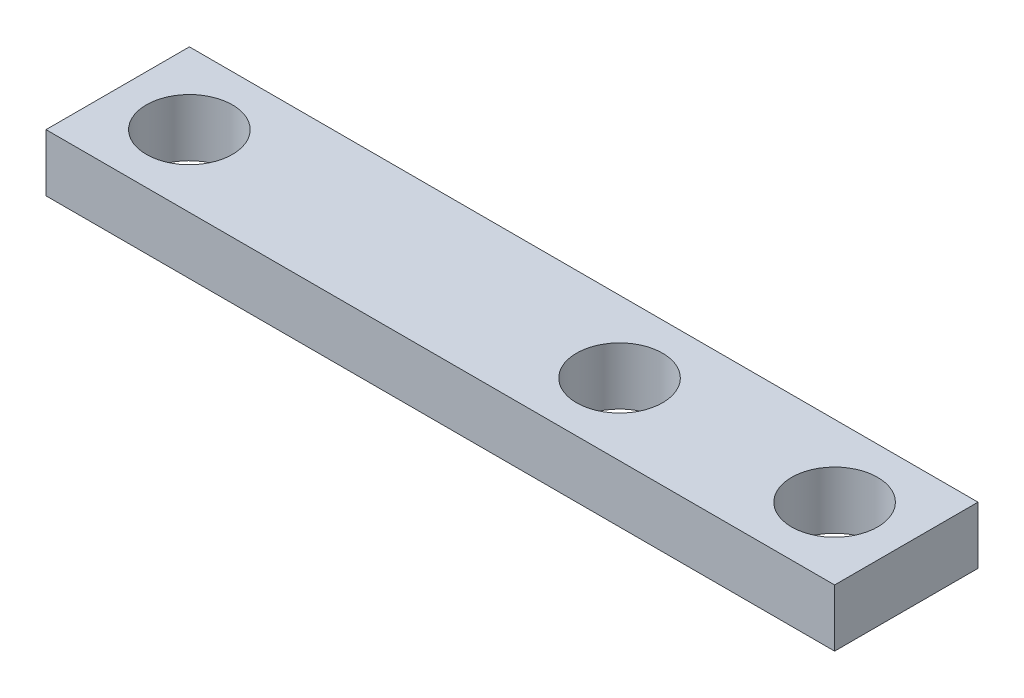
ISO-10303-21;
HEADER;
FILE_DESCRIPTION(('STEP AP214'),'2;1');
FILE_NAME('part.step','',(''),(''),'','','');
FILE_SCHEMA(('AUTOMOTIVE_DESIGN { 1 0 10303 214 1 1 1 1 }'));
ENDSEC;
DATA;
#1=APPLICATION_CONTEXT('core data for automotive mechanical design processes');
#2=APPLICATION_PROTOCOL_DEFINITION('international standard','automotive_design',2000,#1);
#3=PRODUCT_CONTEXT('',#1,'mechanical');
#4=PRODUCT('Part','Part','',(#3));
#5=PRODUCT_RELATED_PRODUCT_CATEGORY('part','',(#4));
#6=PRODUCT_DEFINITION_FORMATION('','',#4);
#7=PRODUCT_DEFINITION_CONTEXT('part definition',#1,'design');
#8=PRODUCT_DEFINITION('design','',#6,#7);
#9=PRODUCT_DEFINITION_SHAPE('','',#8);
#10=(LENGTH_UNIT() NAMED_UNIT(*) SI_UNIT(.MILLI.,.METRE.));
#11=(NAMED_UNIT(*) PLANE_ANGLE_UNIT() SI_UNIT($,.RADIAN.));
#12=(NAMED_UNIT(*) SI_UNIT($,.STERADIAN.) SOLID_ANGLE_UNIT());
#13=UNCERTAINTY_MEASURE_WITH_UNIT(LENGTH_MEASURE(1.E-05),#10,'distance_accuracy_value','');
#14=(GEOMETRIC_REPRESENTATION_CONTEXT(3) GLOBAL_UNCERTAINTY_ASSIGNED_CONTEXT((#13)) GLOBAL_UNIT_ASSIGNED_CONTEXT((#10,
#11,#12)) REPRESENTATION_CONTEXT('',''));
#15=CARTESIAN_POINT('',(0.,0.,0.));
#16=DIRECTION('',(0.,0.,1.));
#17=DIRECTION('',(1.,0.,0.));
#18=AXIS2_PLACEMENT_3D('',#15,#16,#17);
#19=CARTESIAN_POINT('',(0.,2.54,0.));
#20=DIRECTION('',(0.,1.,0.));
#21=DIRECTION('',(0.,0.,1.));
#22=AXIS2_PLACEMENT_3D('',#19,#20,#21);
#23=PLANE('',#22);
#24=CARTESIAN_POINT('',(9.525,2.54,0.));
#25=DIRECTION('',(0.,1.,0.));
#26=DIRECTION('',(0.,0.,1.));
#27=AXIS2_PLACEMENT_3D('',#24,#25,#26);
#28=CIRCLE('',#27,1.905);
#29=CARTESIAN_POINT('',(9.525,2.54,1.905));
#30=VERTEX_POINT('',#29);
#31=EDGE_CURVE('E140',#30,#30,#28,.T.);
#32=ORIENTED_EDGE('',*,*,#31,.F.);
#33=EDGE_LOOP('',(#32));
#34=FACE_BOUND('',#33,.T.);
#35=DIRECTION('',(0.,0.,-1.));
#36=VECTOR('',#35,1.);
#37=CARTESIAN_POINT('',(12.7,2.54,3.175));
#38=LINE('',#37,#36);
#39=CARTESIAN_POINT('',(12.7,2.54,3.175));
#40=VERTEX_POINT('',#39);
#41=CARTESIAN_POINT('',(12.7,2.54,-3.175));
#42=VERTEX_POINT('',#41);
#43=EDGE_CURVE('E98',#40,#42,#38,.T.);
#44=ORIENTED_EDGE('',*,*,#43,.T.);
#45=DIRECTION('',(-1.,0.,0.));
#46=VECTOR('',#45,1.);
#47=CARTESIAN_POINT('',(12.7,2.54,-3.175));
#48=LINE('',#47,#46);
#49=CARTESIAN_POINT('',(-22.225,2.54,-3.175));
#50=VERTEX_POINT('',#49);
#51=EDGE_CURVE('E93',#42,#50,#48,.T.);
#52=ORIENTED_EDGE('',*,*,#51,.T.);
#53=DIRECTION('',(0.,0.,1.));
#54=VECTOR('',#53,1.);
#55=CARTESIAN_POINT('',(-22.225,2.54,3.175));
#56=LINE('',#55,#54);
#57=CARTESIAN_POINT('',(-22.225,2.54,3.175));
#58=VERTEX_POINT('',#57);
#59=EDGE_CURVE('E96',#50,#58,#56,.T.);
#60=ORIENTED_EDGE('',*,*,#59,.T.);
#61=DIRECTION('',(1.,0.,0.));
#62=VECTOR('',#61,1.);
#63=CARTESIAN_POINT('',(12.7,2.54,3.175));
#64=LINE('',#63,#62);
#65=EDGE_CURVE('E63',#58,#40,#64,.T.);
#66=ORIENTED_EDGE('',*,*,#65,.T.);
#67=EDGE_LOOP('',(#44,#52,#60,#66));
#68=FACE_BOUND('',#67,.T.);
#69=CARTESIAN_POINT('',(-19.05,2.54,0.));
#70=DIRECTION('',(0.,1.,0.));
#71=DIRECTION('',(0.,0.,1.));
#72=AXIS2_PLACEMENT_3D('',#69,#70,#71);
#73=CIRCLE('',#72,1.905);
#74=CARTESIAN_POINT('',(-19.05,2.54,1.905));
#75=VERTEX_POINT('',#74);
#76=EDGE_CURVE('E118',#75,#75,#73,.T.);
#77=ORIENTED_EDGE('',*,*,#76,.F.);
#78=EDGE_LOOP('',(#77));
#79=FACE_BOUND('',#78,.T.);
#80=CARTESIAN_POINT('',(0.,2.54,0.));
#81=DIRECTION('',(0.,1.,0.));
#82=DIRECTION('',(0.,0.,1.));
#83=AXIS2_PLACEMENT_3D('',#80,#81,#82);
#84=CIRCLE('',#83,1.905);
#85=CARTESIAN_POINT('',(0.,2.54,1.905));
#86=VERTEX_POINT('',#85);
#87=EDGE_CURVE('E148',#86,#86,#84,.T.);
#88=ORIENTED_EDGE('',*,*,#87,.F.);
#89=EDGE_LOOP('',(#88));
#90=FACE_BOUND('',#89,.T.);
#91=ADVANCED_FACE('F45',(#34,#68,#79,#90),#23,.T.);
#92=CARTESIAN_POINT('',(0.,0.,0.));
#93=DIRECTION('',(0.,1.,0.));
#94=DIRECTION('',(0.,0.,1.));
#95=AXIS2_PLACEMENT_3D('',#92,#93,#94);
#96=PLANE('',#95);
#97=DIRECTION('',(0.,0.,-1.));
#98=VECTOR('',#97,1.);
#99=CARTESIAN_POINT('',(12.7,0.,3.175));
#100=LINE('',#99,#98);
#101=CARTESIAN_POINT('',(12.7,0.,3.175));
#102=VERTEX_POINT('',#101);
#103=CARTESIAN_POINT('',(12.7,0.,-3.175));
#104=VERTEX_POINT('',#103);
#105=EDGE_CURVE('E114',#102,#104,#100,.T.);
#106=ORIENTED_EDGE('',*,*,#105,.F.);
#107=DIRECTION('',(1.,0.,0.));
#108=VECTOR('',#107,1.);
#109=CARTESIAN_POINT('',(12.7,0.,3.175));
#110=LINE('',#109,#108);
#111=CARTESIAN_POINT('',(-22.225,0.,3.175));
#112=VERTEX_POINT('',#111);
#113=EDGE_CURVE('E86',#112,#102,#110,.T.);
#114=ORIENTED_EDGE('',*,*,#113,.F.);
#115=DIRECTION('',(0.,0.,1.));
#116=VECTOR('',#115,1.);
#117=CARTESIAN_POINT('',(-22.225,0.,3.175));
#118=LINE('',#117,#116);
#119=CARTESIAN_POINT('',(-22.225,0.,-3.175));
#120=VERTEX_POINT('',#119);
#121=EDGE_CURVE('E80',#120,#112,#118,.T.);
#122=ORIENTED_EDGE('',*,*,#121,.F.);
#123=DIRECTION('',(-1.,0.,0.));
#124=VECTOR('',#123,1.);
#125=CARTESIAN_POINT('',(12.7,0.,-3.175));
#126=LINE('',#125,#124);
#127=EDGE_CURVE('E103',#104,#120,#126,.T.);
#128=ORIENTED_EDGE('',*,*,#127,.F.);
#129=EDGE_LOOP('',(#106,#114,#122,#128));
#130=FACE_BOUND('',#129,.T.);
#131=CARTESIAN_POINT('',(-19.05,0.,0.));
#132=DIRECTION('',(0.,1.,0.));
#133=DIRECTION('',(0.,0.,1.));
#134=AXIS2_PLACEMENT_3D('',#131,#132,#133);
#135=CIRCLE('',#134,1.905);
#136=CARTESIAN_POINT('',(-19.05,0.,1.905));
#137=VERTEX_POINT('',#136);
#138=EDGE_CURVE('E136',#137,#137,#135,.T.);
#139=ORIENTED_EDGE('',*,*,#138,.T.);
#140=EDGE_LOOP('',(#139));
#141=FACE_BOUND('',#140,.T.);
#142=CARTESIAN_POINT('',(9.525,0.,0.));
#143=DIRECTION('',(0.,1.,0.));
#144=DIRECTION('',(0.,0.,1.));
#145=AXIS2_PLACEMENT_3D('',#142,#143,#144);
#146=CIRCLE('',#145,1.905);
#147=CARTESIAN_POINT('',(9.525,0.,1.905));
#148=VERTEX_POINT('',#147);
#149=EDGE_CURVE('E144',#148,#148,#146,.T.);
#150=ORIENTED_EDGE('',*,*,#149,.T.);
#151=EDGE_LOOP('',(#150));
#152=FACE_BOUND('',#151,.T.);
#153=CARTESIAN_POINT('',(0.,0.,0.));
#154=DIRECTION('',(0.,1.,0.));
#155=DIRECTION('',(0.,0.,1.));
#156=AXIS2_PLACEMENT_3D('',#153,#154,#155);
#157=CIRCLE('',#156,1.905);
#158=CARTESIAN_POINT('',(0.,0.,1.905));
#159=VERTEX_POINT('',#158);
#160=EDGE_CURVE('E152',#159,#159,#157,.T.);
#161=ORIENTED_EDGE('',*,*,#160,.T.);
#162=EDGE_LOOP('',(#161));
#163=FACE_BOUND('',#162,.T.);
#164=ADVANCED_FACE('F131',(#130,#141,#152,#163),#96,.F.);
#165=CARTESIAN_POINT('',(12.7,2.54,3.175));
#166=DIRECTION('',(-1.,0.,0.));
#167=DIRECTION('',(0.,0.,1.));
#168=AXIS2_PLACEMENT_3D('',#165,#166,#167);
#169=PLANE('',#168);
#170=ORIENTED_EDGE('',*,*,#105,.T.);
#171=DIRECTION('',(0.,-1.,0.));
#172=VECTOR('',#171,1.);
#173=CARTESIAN_POINT('',(12.7,2.54,-3.175));
#174=LINE('',#173,#172);
#175=EDGE_CURVE('E11',#42,#104,#174,.T.);
#176=ORIENTED_EDGE('',*,*,#175,.F.);
#177=ORIENTED_EDGE('',*,*,#43,.F.);
#178=DIRECTION('',(0.,-1.,0.));
#179=VECTOR('',#178,1.);
#180=CARTESIAN_POINT('',(12.7,2.54,3.175));
#181=LINE('',#180,#179);
#182=EDGE_CURVE('E110',#40,#102,#181,.T.);
#183=ORIENTED_EDGE('',*,*,#182,.T.);
#184=EDGE_LOOP('',(#170,#176,#177,#183));
#185=FACE_BOUND('',#184,.T.);
#186=ADVANCED_FACE('F47',(#185),#169,.F.);
#187=CARTESIAN_POINT('',(12.7,2.54,-3.175));
#188=DIRECTION('',(0.,0.,1.));
#189=DIRECTION('',(1.,0.,0.));
#190=AXIS2_PLACEMENT_3D('',#187,#188,#189);
#191=PLANE('',#190);
#192=ORIENTED_EDGE('',*,*,#127,.T.);
#193=DIRECTION('',(0.,-1.,0.));
#194=VECTOR('',#193,1.);
#195=CARTESIAN_POINT('',(-22.225,2.54,-3.175));
#196=LINE('',#195,#194);
#197=EDGE_CURVE('E55',#50,#120,#196,.T.);
#198=ORIENTED_EDGE('',*,*,#197,.F.);
#199=ORIENTED_EDGE('',*,*,#51,.F.);
#200=ORIENTED_EDGE('',*,*,#175,.T.);
#201=EDGE_LOOP('',(#192,#198,#199,#200));
#202=FACE_BOUND('',#201,.T.);
#203=ADVANCED_FACE('F102',(#202),#191,.F.);
#204=CARTESIAN_POINT('',(-22.225,2.54,3.175));
#205=DIRECTION('',(1.,0.,0.));
#206=DIRECTION('',(0.,0.,-1.));
#207=AXIS2_PLACEMENT_3D('',#204,#205,#206);
#208=PLANE('',#207);
#209=ORIENTED_EDGE('',*,*,#121,.T.);
#210=DIRECTION('',(0.,-1.,0.));
#211=VECTOR('',#210,1.);
#212=CARTESIAN_POINT('',(-22.225,2.54,3.175));
#213=LINE('',#212,#211);
#214=EDGE_CURVE('E105',#58,#112,#213,.T.);
#215=ORIENTED_EDGE('',*,*,#214,.F.);
#216=ORIENTED_EDGE('',*,*,#59,.F.);
#217=ORIENTED_EDGE('',*,*,#197,.T.);
#218=EDGE_LOOP('',(#209,#215,#216,#217));
#219=FACE_BOUND('',#218,.T.);
#220=ADVANCED_FACE('F106',(#219),#208,.F.);
#221=CARTESIAN_POINT('',(12.7,2.54,3.175));
#222=DIRECTION('',(0.,0.,-1.));
#223=DIRECTION('',(-1.,0.,0.));
#224=AXIS2_PLACEMENT_3D('',#221,#222,#223);
#225=PLANE('',#224);
#226=ORIENTED_EDGE('',*,*,#113,.T.);
#227=ORIENTED_EDGE('',*,*,#182,.F.);
#228=ORIENTED_EDGE('',*,*,#65,.F.);
#229=ORIENTED_EDGE('',*,*,#214,.T.);
#230=EDGE_LOOP('',(#226,#227,#228,#229));
#231=FACE_BOUND('',#230,.T.);
#232=ADVANCED_FACE('F128',(#231),#225,.F.);
#233=CARTESIAN_POINT('',(-19.05,2.54,0.));
#234=DIRECTION('',(0.,-1.,0.));
#235=DIRECTION('',(0.,0.,-1.));
#236=AXIS2_PLACEMENT_3D('',#233,#234,#235);
#237=CYLINDRICAL_SURFACE('',#236,1.905);
#238=ORIENTED_EDGE('',*,*,#76,.T.);
#239=EDGE_LOOP('',(#238));
#240=FACE_BOUND('',#239,.T.);
#241=ORIENTED_EDGE('',*,*,#138,.F.);
#242=EDGE_LOOP('',(#241));
#243=FACE_BOUND('',#242,.T.);
#244=ADVANCED_FACE('F172',(#240,#243),#237,.F.);
#245=CARTESIAN_POINT('',(9.525,2.54,0.));
#246=DIRECTION('',(0.,-1.,0.));
#247=DIRECTION('',(0.,0.,-1.));
#248=AXIS2_PLACEMENT_3D('',#245,#246,#247);
#249=CYLINDRICAL_SURFACE('',#248,1.905);
#250=ORIENTED_EDGE('',*,*,#31,.T.);
#251=EDGE_LOOP('',(#250));
#252=FACE_BOUND('',#251,.T.);
#253=ORIENTED_EDGE('',*,*,#149,.F.);
#254=EDGE_LOOP('',(#253));
#255=FACE_BOUND('',#254,.T.);
#256=ADVANCED_FACE('F217',(#252,#255),#249,.F.);
#257=CARTESIAN_POINT('',(0.,2.54,0.));
#258=DIRECTION('',(0.,-1.,0.));
#259=DIRECTION('',(0.,0.,-1.));
#260=AXIS2_PLACEMENT_3D('',#257,#258,#259);
#261=CYLINDRICAL_SURFACE('',#260,1.905);
#262=ORIENTED_EDGE('',*,*,#87,.T.);
#263=EDGE_LOOP('',(#262));
#264=FACE_BOUND('',#263,.T.);
#265=ORIENTED_EDGE('',*,*,#160,.F.);
#266=EDGE_LOOP('',(#265));
#267=FACE_BOUND('',#266,.T.);
#268=ADVANCED_FACE('F160',(#264,#267),#261,.F.);
#269=CLOSED_SHELL('',(#91,#164,#186,#203,#220,#232,#244,#256,#268));
#270=MANIFOLD_SOLID_BREP('B2',#269);
#271=ADVANCED_BREP_SHAPE_REPRESENTATION('',(#18,#270),#14);
#272=SHAPE_DEFINITION_REPRESENTATION(#9,#271);
ENDSEC;
END-ISO-10303-21;
